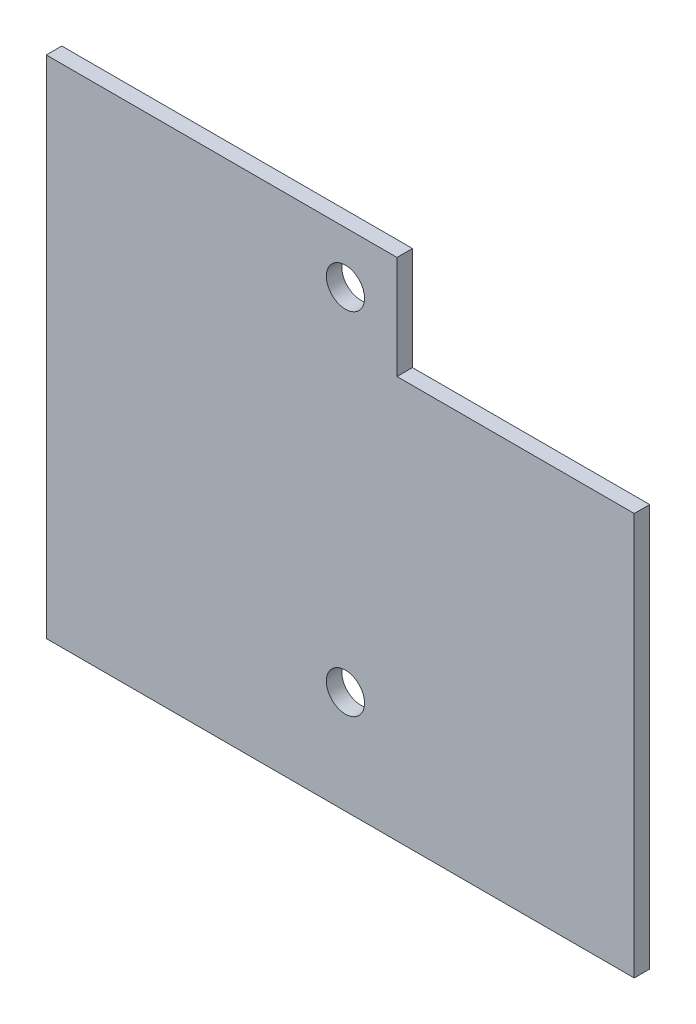
ISO-10303-21;
HEADER;
FILE_DESCRIPTION(('STEP AP214'),'2;1');
FILE_NAME('part.step','',(''),(''),'','','');
FILE_SCHEMA(('AUTOMOTIVE_DESIGN { 1 0 10303 214 1 1 1 1 }'));
ENDSEC;
DATA;
#1=APPLICATION_CONTEXT('core data for automotive mechanical design processes');
#2=APPLICATION_PROTOCOL_DEFINITION('international standard','automotive_design',2000,#1);
#3=PRODUCT_CONTEXT('',#1,'mechanical');
#4=PRODUCT('Part','Part','',(#3));
#5=PRODUCT_RELATED_PRODUCT_CATEGORY('part','',(#4));
#6=PRODUCT_DEFINITION_FORMATION('','',#4);
#7=PRODUCT_DEFINITION_CONTEXT('part definition',#1,'design');
#8=PRODUCT_DEFINITION('design','',#6,#7);
#9=PRODUCT_DEFINITION_SHAPE('','',#8);
#10=(LENGTH_UNIT() NAMED_UNIT(*) SI_UNIT(.MILLI.,.METRE.));
#11=(NAMED_UNIT(*) PLANE_ANGLE_UNIT() SI_UNIT($,.RADIAN.));
#12=(NAMED_UNIT(*) SI_UNIT($,.STERADIAN.) SOLID_ANGLE_UNIT());
#13=UNCERTAINTY_MEASURE_WITH_UNIT(LENGTH_MEASURE(1.E-05),#10,'distance_accuracy_value','');
#14=(GEOMETRIC_REPRESENTATION_CONTEXT(3) GLOBAL_UNCERTAINTY_ASSIGNED_CONTEXT((#13)) GLOBAL_UNIT_ASSIGNED_CONTEXT((#10,
#11,#12)) REPRESENTATION_CONTEXT('',''));
#15=CARTESIAN_POINT('',(0.,0.,0.));
#16=DIRECTION('',(0.,0.,1.));
#17=DIRECTION('',(1.,0.,0.));
#18=AXIS2_PLACEMENT_3D('',#15,#16,#17);
#19=CARTESIAN_POINT('',(57.,0.,1.5));
#20=DIRECTION('',(0.,0.,1.));
#21=DIRECTION('',(1.,0.,0.));
#22=AXIS2_PLACEMENT_3D('',#19,#20,#21);
#23=PLANE('',#22);
#24=CARTESIAN_POINT('',(29.,44.,1.5));
#25=DIRECTION('',(0.,0.,1.));
#26=DIRECTION('',(1.,0.,0.));
#27=AXIS2_PLACEMENT_3D('',#24,#25,#26);
#28=CIRCLE('',#27,1.85);
#29=CARTESIAN_POINT('',(30.85,44.,1.5));
#30=VERTEX_POINT('',#29);
#31=EDGE_CURVE('E102',#30,#30,#28,.T.);
#32=ORIENTED_EDGE('',*,*,#31,.F.);
#33=EDGE_LOOP('',(#32));
#34=FACE_BOUND('',#33,.T.);
#35=DIRECTION('',(1.,0.,0.));
#36=VECTOR('',#35,1.);
#37=CARTESIAN_POINT('',(57.,0.,1.5));
#38=LINE('',#37,#36);
#39=CARTESIAN_POINT('',(0.,0.,1.5));
#40=VERTEX_POINT('',#39);
#41=CARTESIAN_POINT('',(57.,0.,1.5));
#42=VERTEX_POINT('',#41);
#43=EDGE_CURVE('E116',#40,#42,#38,.T.);
#44=ORIENTED_EDGE('',*,*,#43,.T.);
#45=DIRECTION('',(0.,1.,0.));
#46=VECTOR('',#45,1.);
#47=CARTESIAN_POINT('',(57.,39.,1.5));
#48=LINE('',#47,#46);
#49=CARTESIAN_POINT('',(57.,39.,1.5));
#50=VERTEX_POINT('',#49);
#51=EDGE_CURVE('E97',#42,#50,#48,.T.);
#52=ORIENTED_EDGE('',*,*,#51,.T.);
#53=DIRECTION('',(-1.,0.,0.));
#54=VECTOR('',#53,1.);
#55=CARTESIAN_POINT('',(34.,39.,1.5));
#56=LINE('',#55,#54);
#57=CARTESIAN_POINT('',(34.,39.,1.5));
#58=VERTEX_POINT('',#57);
#59=EDGE_CURVE('E119',#50,#58,#56,.T.);
#60=ORIENTED_EDGE('',*,*,#59,.T.);
#61=DIRECTION('',(0.,1.,0.));
#62=VECTOR('',#61,1.);
#63=CARTESIAN_POINT('',(34.,49.,1.5));
#64=LINE('',#63,#62);
#65=CARTESIAN_POINT('',(34.,49.,1.5));
#66=VERTEX_POINT('',#65);
#67=EDGE_CURVE('E121',#58,#66,#64,.T.);
#68=ORIENTED_EDGE('',*,*,#67,.T.);
#69=DIRECTION('',(-1.,0.,0.));
#70=VECTOR('',#69,1.);
#71=CARTESIAN_POINT('',(0.,49.,1.5));
#72=LINE('',#71,#70);
#73=CARTESIAN_POINT('',(0.,49.,1.5));
#74=VERTEX_POINT('',#73);
#75=EDGE_CURVE('E50',#66,#74,#72,.T.);
#76=ORIENTED_EDGE('',*,*,#75,.T.);
#77=DIRECTION('',(0.,-1.,0.));
#78=VECTOR('',#77,1.);
#79=CARTESIAN_POINT('',(0.,0.,1.5));
#80=LINE('',#79,#78);
#81=EDGE_CURVE('E45',#74,#40,#80,.T.);
#82=ORIENTED_EDGE('',*,*,#81,.T.);
#83=EDGE_LOOP('',(#44,#52,#60,#68,#76,#82));
#84=FACE_BOUND('',#83,.T.);
#85=CARTESIAN_POINT('',(29.,10.,1.5));
#86=DIRECTION('',(0.,0.,1.));
#87=DIRECTION('',(1.,0.,0.));
#88=AXIS2_PLACEMENT_3D('',#85,#86,#87);
#89=CIRCLE('',#88,1.85);
#90=CARTESIAN_POINT('',(30.85,10.,1.5));
#91=VERTEX_POINT('',#90);
#92=EDGE_CURVE('E176',#91,#91,#89,.T.);
#93=ORIENTED_EDGE('',*,*,#92,.F.);
#94=EDGE_LOOP('',(#93));
#95=FACE_BOUND('',#94,.T.);
#96=ADVANCED_FACE('F30',(#34,#84,#95),#23,.T.);
#97=CARTESIAN_POINT('',(57.,0.,0.));
#98=DIRECTION('',(0.,0.,1.));
#99=DIRECTION('',(1.,0.,0.));
#100=AXIS2_PLACEMENT_3D('',#97,#98,#99);
#101=PLANE('',#100);
#102=CARTESIAN_POINT('',(29.,44.,0.));
#103=DIRECTION('',(0.,0.,1.));
#104=DIRECTION('',(1.,0.,0.));
#105=AXIS2_PLACEMENT_3D('',#102,#103,#104);
#106=CIRCLE('',#105,1.85);
#107=CARTESIAN_POINT('',(30.85,44.,0.));
#108=VERTEX_POINT('',#107);
#109=EDGE_CURVE('E105',#108,#108,#106,.T.);
#110=ORIENTED_EDGE('',*,*,#109,.T.);
#111=EDGE_LOOP('',(#110));
#112=FACE_BOUND('',#111,.T.);
#113=DIRECTION('',(1.,0.,0.));
#114=VECTOR('',#113,1.);
#115=CARTESIAN_POINT('',(57.,0.,0.));
#116=LINE('',#115,#114);
#117=CARTESIAN_POINT('',(0.,0.,0.));
#118=VERTEX_POINT('',#117);
#119=CARTESIAN_POINT('',(57.,0.,0.));
#120=VERTEX_POINT('',#119);
#121=EDGE_CURVE('E88',#118,#120,#116,.T.);
#122=ORIENTED_EDGE('',*,*,#121,.F.);
#123=DIRECTION('',(0.,-1.,0.));
#124=VECTOR('',#123,1.);
#125=CARTESIAN_POINT('',(0.,0.,0.));
#126=LINE('',#125,#124);
#127=CARTESIAN_POINT('',(0.,49.,0.));
#128=VERTEX_POINT('',#127);
#129=EDGE_CURVE('E114',#128,#118,#126,.T.);
#130=ORIENTED_EDGE('',*,*,#129,.F.);
#131=DIRECTION('',(-1.,0.,0.));
#132=VECTOR('',#131,1.);
#133=CARTESIAN_POINT('',(0.,49.,0.));
#134=LINE('',#133,#132);
#135=CARTESIAN_POINT('',(34.,49.,0.));
#136=VERTEX_POINT('',#135);
#137=EDGE_CURVE('E112',#136,#128,#134,.T.);
#138=ORIENTED_EDGE('',*,*,#137,.F.);
#139=DIRECTION('',(0.,1.,0.));
#140=VECTOR('',#139,1.);
#141=CARTESIAN_POINT('',(34.,49.,0.));
#142=LINE('',#141,#140);
#143=CARTESIAN_POINT('',(34.,39.,0.));
#144=VERTEX_POINT('',#143);
#145=EDGE_CURVE('E110',#144,#136,#142,.T.);
#146=ORIENTED_EDGE('',*,*,#145,.F.);
#147=DIRECTION('',(-1.,0.,0.));
#148=VECTOR('',#147,1.);
#149=CARTESIAN_POINT('',(34.,39.,0.));
#150=LINE('',#149,#148);
#151=CARTESIAN_POINT('',(57.,39.,0.));
#152=VERTEX_POINT('',#151);
#153=EDGE_CURVE('E90',#152,#144,#150,.T.);
#154=ORIENTED_EDGE('',*,*,#153,.F.);
#155=DIRECTION('',(0.,1.,0.));
#156=VECTOR('',#155,1.);
#157=CARTESIAN_POINT('',(57.,39.,0.));
#158=LINE('',#157,#156);
#159=EDGE_CURVE('E83',#120,#152,#158,.T.);
#160=ORIENTED_EDGE('',*,*,#159,.F.);
#161=EDGE_LOOP('',(#122,#130,#138,#146,#154,#160));
#162=FACE_BOUND('',#161,.T.);
#163=CARTESIAN_POINT('',(29.,10.,0.));
#164=DIRECTION('',(0.,0.,1.));
#165=DIRECTION('',(1.,0.,0.));
#166=AXIS2_PLACEMENT_3D('',#163,#164,#165);
#167=CIRCLE('',#166,1.85);
#168=CARTESIAN_POINT('',(30.85,10.,0.));
#169=VERTEX_POINT('',#168);
#170=EDGE_CURVE('E179',#169,#169,#167,.T.);
#171=ORIENTED_EDGE('',*,*,#170,.T.);
#172=EDGE_LOOP('',(#171));
#173=FACE_BOUND('',#172,.T.);
#174=ADVANCED_FACE('F84',(#112,#162,#173),#101,.F.);
#175=CARTESIAN_POINT('',(57.,0.,1.5));
#176=DIRECTION('',(0.,1.,0.));
#177=DIRECTION('',(-1.,0.,0.));
#178=AXIS2_PLACEMENT_3D('',#175,#176,#177);
#179=PLANE('',#178);
#180=ORIENTED_EDGE('',*,*,#121,.T.);
#181=DIRECTION('',(0.,0.,-1.));
#182=VECTOR('',#181,1.);
#183=CARTESIAN_POINT('',(57.,0.,1.5));
#184=LINE('',#183,#182);
#185=EDGE_CURVE('E11',#42,#120,#184,.T.);
#186=ORIENTED_EDGE('',*,*,#185,.F.);
#187=ORIENTED_EDGE('',*,*,#43,.F.);
#188=DIRECTION('',(0.,0.,-1.));
#189=VECTOR('',#188,1.);
#190=CARTESIAN_POINT('',(0.,0.,1.5));
#191=LINE('',#190,#189);
#192=EDGE_CURVE('E101',#40,#118,#191,.T.);
#193=ORIENTED_EDGE('',*,*,#192,.T.);
#194=EDGE_LOOP('',(#180,#186,#187,#193));
#195=FACE_BOUND('',#194,.T.);
#196=ADVANCED_FACE('F32',(#195),#179,.F.);
#197=CARTESIAN_POINT('',(57.,39.,1.5));
#198=DIRECTION('',(-1.,0.,0.));
#199=DIRECTION('',(0.,-1.,0.));
#200=AXIS2_PLACEMENT_3D('',#197,#198,#199);
#201=PLANE('',#200);
#202=ORIENTED_EDGE('',*,*,#159,.T.);
#203=DIRECTION('',(0.,0.,-1.));
#204=VECTOR('',#203,1.);
#205=CARTESIAN_POINT('',(57.,39.,1.5));
#206=LINE('',#205,#204);
#207=EDGE_CURVE('E38',#50,#152,#206,.T.);
#208=ORIENTED_EDGE('',*,*,#207,.F.);
#209=ORIENTED_EDGE('',*,*,#51,.F.);
#210=ORIENTED_EDGE('',*,*,#185,.T.);
#211=EDGE_LOOP('',(#202,#208,#209,#210));
#212=FACE_BOUND('',#211,.T.);
#213=ADVANCED_FACE('F96',(#212),#201,.F.);
#214=CARTESIAN_POINT('',(34.,39.,1.5));
#215=DIRECTION('',(0.,-1.,0.));
#216=DIRECTION('',(0.,0.,-1.));
#217=AXIS2_PLACEMENT_3D('',#214,#215,#216);
#218=PLANE('',#217);
#219=ORIENTED_EDGE('',*,*,#153,.T.);
#220=DIRECTION('',(0.,0.,-1.));
#221=VECTOR('',#220,1.);
#222=CARTESIAN_POINT('',(34.,39.,1.5));
#223=LINE('',#222,#221);
#224=EDGE_CURVE('E132',#58,#144,#223,.T.);
#225=ORIENTED_EDGE('',*,*,#224,.F.);
#226=ORIENTED_EDGE('',*,*,#59,.F.);
#227=ORIENTED_EDGE('',*,*,#207,.T.);
#228=EDGE_LOOP('',(#219,#225,#226,#227));
#229=FACE_BOUND('',#228,.T.);
#230=ADVANCED_FACE('F136',(#229),#218,.F.);
#231=CARTESIAN_POINT('',(34.,49.,1.5));
#232=DIRECTION('',(-1.,0.,0.));
#233=DIRECTION('',(0.,0.,1.));
#234=AXIS2_PLACEMENT_3D('',#231,#232,#233);
#235=PLANE('',#234);
#236=ORIENTED_EDGE('',*,*,#145,.T.);
#237=DIRECTION('',(0.,0.,-1.));
#238=VECTOR('',#237,1.);
#239=CARTESIAN_POINT('',(34.,49.,1.5));
#240=LINE('',#239,#238);
#241=EDGE_CURVE('E129',#66,#136,#240,.T.);
#242=ORIENTED_EDGE('',*,*,#241,.F.);
#243=ORIENTED_EDGE('',*,*,#67,.F.);
#244=ORIENTED_EDGE('',*,*,#224,.T.);
#245=EDGE_LOOP('',(#236,#242,#243,#244));
#246=FACE_BOUND('',#245,.T.);
#247=ADVANCED_FACE('F142',(#246),#235,.F.);
#248=CARTESIAN_POINT('',(0.,49.,1.5));
#249=DIRECTION('',(0.,-1.,0.));
#250=DIRECTION('',(0.,0.,-1.));
#251=AXIS2_PLACEMENT_3D('',#248,#249,#250);
#252=PLANE('',#251);
#253=ORIENTED_EDGE('',*,*,#137,.T.);
#254=DIRECTION('',(0.,0.,-1.));
#255=VECTOR('',#254,1.);
#256=CARTESIAN_POINT('',(0.,49.,1.5));
#257=LINE('',#256,#255);
#258=EDGE_CURVE('E126',#74,#128,#257,.T.);
#259=ORIENTED_EDGE('',*,*,#258,.F.);
#260=ORIENTED_EDGE('',*,*,#75,.F.);
#261=ORIENTED_EDGE('',*,*,#241,.T.);
#262=EDGE_LOOP('',(#253,#259,#260,#261));
#263=FACE_BOUND('',#262,.T.);
#264=ADVANCED_FACE('F145',(#263),#252,.F.);
#265=CARTESIAN_POINT('',(0.,0.,1.5));
#266=DIRECTION('',(1.,0.,0.));
#267=DIRECTION('',(0.,0.,-1.));
#268=AXIS2_PLACEMENT_3D('',#265,#266,#267);
#269=PLANE('',#268);
#270=ORIENTED_EDGE('',*,*,#129,.T.);
#271=ORIENTED_EDGE('',*,*,#192,.F.);
#272=ORIENTED_EDGE('',*,*,#81,.F.);
#273=ORIENTED_EDGE('',*,*,#258,.T.);
#274=EDGE_LOOP('',(#270,#271,#272,#273));
#275=FACE_BOUND('',#274,.T.);
#276=ADVANCED_FACE('F147',(#275),#269,.F.);
#277=CARTESIAN_POINT('',(29.,44.,1.5));
#278=DIRECTION('',(0.,0.,-1.));
#279=DIRECTION('',(-1.,0.,0.));
#280=AXIS2_PLACEMENT_3D('',#277,#278,#279);
#281=CYLINDRICAL_SURFACE('',#280,1.85);
#282=ORIENTED_EDGE('',*,*,#31,.T.);
#283=EDGE_LOOP('',(#282));
#284=FACE_BOUND('',#283,.T.);
#285=ORIENTED_EDGE('',*,*,#109,.F.);
#286=EDGE_LOOP('',(#285));
#287=FACE_BOUND('',#286,.T.);
#288=ADVANCED_FACE('F149',(#284,#287),#281,.F.);
#289=CARTESIAN_POINT('',(29.,10.,1.5));
#290=DIRECTION('',(0.,0.,-1.));
#291=DIRECTION('',(-1.,0.,0.));
#292=AXIS2_PLACEMENT_3D('',#289,#290,#291);
#293=CYLINDRICAL_SURFACE('',#292,1.85);
#294=ORIENTED_EDGE('',*,*,#92,.T.);
#295=EDGE_LOOP('',(#294));
#296=FACE_BOUND('',#295,.T.);
#297=ORIENTED_EDGE('',*,*,#170,.F.);
#298=EDGE_LOOP('',(#297));
#299=FACE_BOUND('',#298,.T.);
#300=ADVANCED_FACE('F155',(#296,#299),#293,.F.);
#301=CLOSED_SHELL('',(#96,#174,#196,#213,#230,#247,#264,#276,#288,#300));
#302=MANIFOLD_SOLID_BREP('B2',#301);
#303=ADVANCED_BREP_SHAPE_REPRESENTATION('',(#18,#302),#14);
#304=SHAPE_DEFINITION_REPRESENTATION(#9,#303);
ENDSEC;
END-ISO-10303-21;
